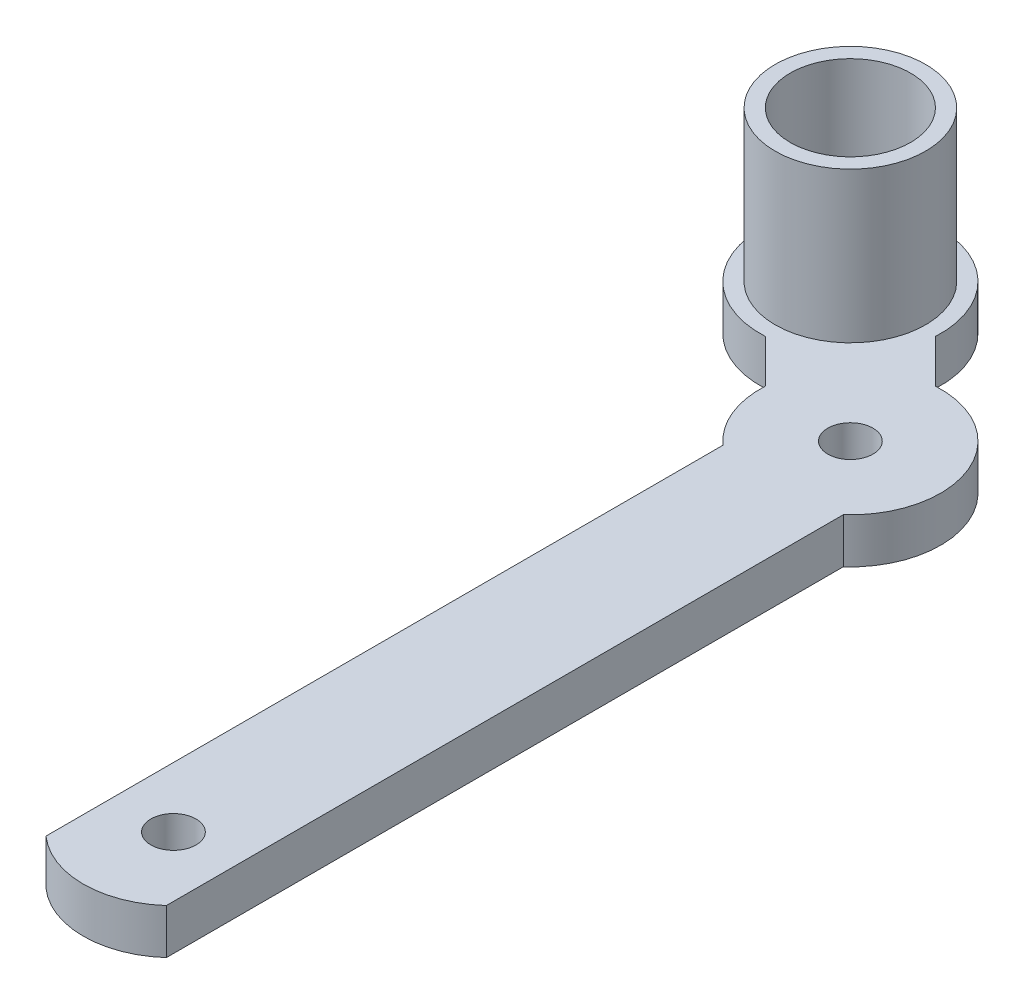
ISO-10303-21;
HEADER;
FILE_DESCRIPTION(('STEP AP214'),'2;1');
FILE_NAME('part.step','',(''),(''),'','','');
FILE_SCHEMA(('AUTOMOTIVE_DESIGN { 1 0 10303 214 1 1 1 1 }'));
ENDSEC;
DATA;
#1=APPLICATION_CONTEXT('core data for automotive mechanical design processes');
#2=APPLICATION_PROTOCOL_DEFINITION('international standard','automotive_design',2000,#1);
#3=PRODUCT_CONTEXT('',#1,'mechanical');
#4=PRODUCT('Part','Part','',(#3));
#5=PRODUCT_RELATED_PRODUCT_CATEGORY('part','',(#4));
#6=PRODUCT_DEFINITION_FORMATION('','',#4);
#7=PRODUCT_DEFINITION_CONTEXT('part definition',#1,'design');
#8=PRODUCT_DEFINITION('design','',#6,#7);
#9=PRODUCT_DEFINITION_SHAPE('','',#8);
#10=(LENGTH_UNIT() NAMED_UNIT(*) SI_UNIT(.MILLI.,.METRE.));
#11=(NAMED_UNIT(*) PLANE_ANGLE_UNIT() SI_UNIT($,.RADIAN.));
#12=(NAMED_UNIT(*) SI_UNIT($,.STERADIAN.) SOLID_ANGLE_UNIT());
#13=UNCERTAINTY_MEASURE_WITH_UNIT(LENGTH_MEASURE(1.E-05),#10,'distance_accuracy_value','');
#14=(GEOMETRIC_REPRESENTATION_CONTEXT(3) GLOBAL_UNCERTAINTY_ASSIGNED_CONTEXT((#13)) GLOBAL_UNIT_ASSIGNED_CONTEXT((#10,
#11,#12)) REPRESENTATION_CONTEXT('',''));
#15=CARTESIAN_POINT('',(0.,0.,0.));
#16=DIRECTION('',(0.,0.,1.));
#17=DIRECTION('',(1.,0.,0.));
#18=AXIS2_PLACEMENT_3D('',#15,#16,#17);
#19=CARTESIAN_POINT('',(0.,3.,0.));
#20=DIRECTION('',(0.,1.,0.));
#21=DIRECTION('',(0.,0.,1.));
#22=AXIS2_PLACEMENT_3D('',#19,#20,#21);
#23=PLANE('',#22);
#24=CARTESIAN_POINT('',(-9.19238815542517,3.,-54.1923881554251));
#25=DIRECTION('',(0.,1.,0.));
#26=DIRECTION('',(0.,0.,1.));
#27=AXIS2_PLACEMENT_3D('',#24,#25,#26);
#28=CIRCLE('',#27,3.);
#29=CARTESIAN_POINT('',(-9.19238815542517,3.,-51.1923881554251));
#30=VERTEX_POINT('',#29);
#31=EDGE_CURVE('E171',#30,#30,#28,.T.);
#32=ORIENTED_EDGE('',*,*,#31,.F.);
#33=EDGE_LOOP('',(#32));
#34=FACE_BOUND('',#33,.T.);
#35=CARTESIAN_POINT('',(-9.19238815542517,3.,-54.1923881554251));
#36=DIRECTION('',(0.,1.,0.));
#37=DIRECTION('',(0.,0.,1.));
#38=AXIS2_PLACEMENT_3D('',#35,#36,#37);
#39=CIRCLE('',#38,4.);
#40=CARTESIAN_POINT('',(-9.19238815542517,3.,-50.1923881554251));
#41=VERTEX_POINT('',#40);
#42=EDGE_CURVE('E11',#41,#41,#39,.F.);
#43=ORIENTED_EDGE('',*,*,#42,.F.);
#44=EDGE_LOOP('',(#43));
#45=FACE_BOUND('',#44,.T.);
#46=ADVANCED_FACE('F35',(#34,#45),#23,.T.);
#47=CARTESIAN_POINT('',(19.6715728752538,3.,-19.6715728752539));
#48=DIRECTION('',(-0.707106781186546,0.,0.707106781186549));
#49=DIRECTION('',(0.707106781186549,0.,0.707106781186546));
#50=AXIS2_PLACEMENT_3D('',#47,#48,#49);
#51=PLANE('',#50);
#52=DIRECTION('',(-0.707106781186549,0.,-0.707106781186546));
#53=VECTOR('',#52,1.);
#54=CARTESIAN_POINT('',(19.6715728752538,0.,-19.6715728752539));
#55=LINE('',#54,#53);
#56=CARTESIAN_POINT('',(-5.99070478491457,0.,-45.3338505354222));
#57=VERTEX_POINT('',#56);
#58=CARTESIAN_POINT('',(-8.85853762000289,0.,-48.2016833705105));
#59=VERTEX_POINT('',#58);
#60=EDGE_CURVE('E148',#57,#59,#55,.T.);
#61=ORIENTED_EDGE('',*,*,#60,.F.);
#62=DIRECTION('',(0.,-1.,0.));
#63=VECTOR('',#62,1.);
#64=CARTESIAN_POINT('',(-5.99070478491457,3.,-45.3338505354222));
#65=LINE('',#64,#63);
#66=CARTESIAN_POINT('',(-5.99070478491457,3.,-45.3338505354222));
#67=VERTEX_POINT('',#66);
#68=EDGE_CURVE('E44',#67,#57,#65,.T.);
#69=ORIENTED_EDGE('',*,*,#68,.F.);
#70=DIRECTION('',(-0.707106781186549,0.,-0.707106781186546));
#71=VECTOR('',#70,1.);
#72=CARTESIAN_POINT('',(19.6715728752538,3.,-19.6715728752539));
#73=LINE('',#72,#71);
#74=CARTESIAN_POINT('',(-8.85853762000289,3.,-48.2016833705105));
#75=VERTEX_POINT('',#74);
#76=EDGE_CURVE('E226',#67,#75,#73,.T.);
#77=ORIENTED_EDGE('',*,*,#76,.T.);
#78=DIRECTION('',(0.,-1.,0.));
#79=VECTOR('',#78,1.);
#80=CARTESIAN_POINT('',(-8.85853762000289,3.,-48.2016833705105));
#81=LINE('',#80,#79);
#82=EDGE_CURVE('E87',#75,#59,#81,.T.);
#83=ORIENTED_EDGE('',*,*,#82,.T.);
#84=EDGE_LOOP('',(#61,#69,#77,#83));
#85=FACE_BOUND('',#84,.T.);
#86=ADVANCED_FACE('F153',(#85),#51,.T.);
#87=CARTESIAN_POINT('',(0.,3.,-45.));
#88=DIRECTION('',(0.,-1.,0.));
#89=DIRECTION('',(0.,0.,-1.));
#90=AXIS2_PLACEMENT_3D('',#87,#88,#89);
#91=CYLINDRICAL_SURFACE('',#90,6.);
#92=CARTESIAN_POINT('',(0.,0.,-45.));
#93=DIRECTION('',(0.,1.,0.));
#94=DIRECTION('',(0.,0.,1.));
#95=AXIS2_PLACEMENT_3D('',#92,#93,#94);
#96=CIRCLE('',#95,6.);
#97=CARTESIAN_POINT('',(-4.,0.,-40.5278640450004));
#98=VERTEX_POINT('',#97);
#99=EDGE_CURVE('E144',#57,#98,#96,.T.);
#100=ORIENTED_EDGE('',*,*,#99,.T.);
#101=DIRECTION('',(0.,-1.,0.));
#102=VECTOR('',#101,1.);
#103=CARTESIAN_POINT('',(-4.,3.,-40.5278640450004));
#104=LINE('',#103,#102);
#105=CARTESIAN_POINT('',(-4.,3.,-40.5278640450004));
#106=VERTEX_POINT('',#105);
#107=EDGE_CURVE('E138',#106,#98,#104,.T.);
#108=ORIENTED_EDGE('',*,*,#107,.F.);
#109=CARTESIAN_POINT('',(0.,3.,-45.));
#110=DIRECTION('',(0.,1.,0.));
#111=DIRECTION('',(0.,0.,1.));
#112=AXIS2_PLACEMENT_3D('',#109,#110,#111);
#113=CIRCLE('',#112,6.);
#114=EDGE_CURVE('E146',#67,#106,#113,.T.);
#115=ORIENTED_EDGE('',*,*,#114,.F.);
#116=ORIENTED_EDGE('',*,*,#68,.T.);
#117=EDGE_LOOP('',(#100,#108,#115,#116));
#118=FACE_BOUND('',#117,.T.);
#119=ADVANCED_FACE('F142',(#118),#91,.T.);
#120=CARTESIAN_POINT('',(-4.,3.,0.));
#121=DIRECTION('',(-1.,0.,0.));
#122=DIRECTION('',(0.,0.,1.));
#123=AXIS2_PLACEMENT_3D('',#120,#121,#122);
#124=PLANE('',#123);
#125=DIRECTION('',(0.,0.,-1.));
#126=VECTOR('',#125,1.);
#127=CARTESIAN_POINT('',(-4.,0.,0.));
#128=LINE('',#127,#126);
#129=CARTESIAN_POINT('',(-4.,0.,4.47213595499958));
#130=VERTEX_POINT('',#129);
#131=EDGE_CURVE('E151',#130,#98,#128,.T.);
#132=ORIENTED_EDGE('',*,*,#131,.F.);
#133=DIRECTION('',(0.,-1.,0.));
#134=VECTOR('',#133,1.);
#135=CARTESIAN_POINT('',(-4.,3.,4.47213595499958));
#136=LINE('',#135,#134);
#137=CARTESIAN_POINT('',(-4.,3.,4.47213595499958));
#138=VERTEX_POINT('',#137);
#139=EDGE_CURVE('E136',#138,#130,#136,.T.);
#140=ORIENTED_EDGE('',*,*,#139,.F.);
#141=DIRECTION('',(0.,0.,-1.));
#142=VECTOR('',#141,1.);
#143=CARTESIAN_POINT('',(-4.,3.,0.));
#144=LINE('',#143,#142);
#145=EDGE_CURVE('E233',#138,#106,#144,.T.);
#146=ORIENTED_EDGE('',*,*,#145,.T.);
#147=ORIENTED_EDGE('',*,*,#107,.T.);
#148=EDGE_LOOP('',(#132,#140,#146,#147));
#149=FACE_BOUND('',#148,.T.);
#150=ADVANCED_FACE('F246',(#149),#124,.T.);
#151=CARTESIAN_POINT('',(0.,3.,0.));
#152=DIRECTION('',(0.,-1.,0.));
#153=DIRECTION('',(0.,0.,-1.));
#154=AXIS2_PLACEMENT_3D('',#151,#152,#153);
#155=CYLINDRICAL_SURFACE('',#154,6.);
#156=CARTESIAN_POINT('',(0.,0.,0.));
#157=DIRECTION('',(0.,1.,0.));
#158=DIRECTION('',(0.,0.,1.));
#159=AXIS2_PLACEMENT_3D('',#156,#157,#158);
#160=CIRCLE('',#159,6.);
#161=CARTESIAN_POINT('',(4.,0.,4.47213595499958));
#162=VERTEX_POINT('',#161);
#163=EDGE_CURVE('E162',#130,#162,#160,.T.);
#164=ORIENTED_EDGE('',*,*,#163,.T.);
#165=DIRECTION('',(0.,-1.,0.));
#166=VECTOR('',#165,1.);
#167=CARTESIAN_POINT('',(4.,3.,4.47213595499958));
#168=LINE('',#167,#166);
#169=CARTESIAN_POINT('',(4.,3.,4.47213595499958));
#170=VERTEX_POINT('',#169);
#171=EDGE_CURVE('E129',#170,#162,#168,.T.);
#172=ORIENTED_EDGE('',*,*,#171,.F.);
#173=CARTESIAN_POINT('',(0.,3.,0.));
#174=DIRECTION('',(0.,1.,0.));
#175=DIRECTION('',(0.,0.,1.));
#176=AXIS2_PLACEMENT_3D('',#173,#174,#175);
#177=CIRCLE('',#176,6.);
#178=EDGE_CURVE('E236',#138,#170,#177,.T.);
#179=ORIENTED_EDGE('',*,*,#178,.F.);
#180=ORIENTED_EDGE('',*,*,#139,.T.);
#181=EDGE_LOOP('',(#164,#172,#179,#180));
#182=FACE_BOUND('',#181,.T.);
#183=ADVANCED_FACE('F242',(#182),#155,.T.);
#184=CARTESIAN_POINT('',(4.,3.,0.));
#185=DIRECTION('',(-1.,0.,0.));
#186=DIRECTION('',(0.,0.,1.));
#187=AXIS2_PLACEMENT_3D('',#184,#185,#186);
#188=PLANE('',#187);
#189=DIRECTION('',(0.,0.,-1.));
#190=VECTOR('',#189,1.);
#191=CARTESIAN_POINT('',(4.,0.,0.));
#192=LINE('',#191,#190);
#193=CARTESIAN_POINT('',(4.,0.,-40.5278640450004));
#194=VERTEX_POINT('',#193);
#195=EDGE_CURVE('E165',#162,#194,#192,.T.);
#196=ORIENTED_EDGE('',*,*,#195,.T.);
#197=DIRECTION('',(0.,-1.,0.));
#198=VECTOR('',#197,1.);
#199=CARTESIAN_POINT('',(4.,3.,-40.5278640450004));
#200=LINE('',#199,#198);
#201=CARTESIAN_POINT('',(4.,3.,-40.5278640450004));
#202=VERTEX_POINT('',#201);
#203=EDGE_CURVE('E127',#202,#194,#200,.T.);
#204=ORIENTED_EDGE('',*,*,#203,.F.);
#205=DIRECTION('',(0.,0.,-1.));
#206=VECTOR('',#205,1.);
#207=CARTESIAN_POINT('',(4.,3.,0.));
#208=LINE('',#207,#206);
#209=EDGE_CURVE('E120',#170,#202,#208,.T.);
#210=ORIENTED_EDGE('',*,*,#209,.F.);
#211=ORIENTED_EDGE('',*,*,#171,.T.);
#212=EDGE_LOOP('',(#196,#204,#210,#211));
#213=FACE_BOUND('',#212,.T.);
#214=ADVANCED_FACE('F244',(#213),#188,.F.);
#215=CARTESIAN_POINT('',(0.,3.,-45.));
#216=DIRECTION('',(0.,-1.,0.));
#217=DIRECTION('',(0.,0.,-1.));
#218=AXIS2_PLACEMENT_3D('',#215,#216,#217);
#219=CYLINDRICAL_SURFACE('',#218,6.);
#220=CARTESIAN_POINT('',(0.,0.,-45.));
#221=DIRECTION('',(0.,1.,0.));
#222=DIRECTION('',(0.,0.,1.));
#223=AXIS2_PLACEMENT_3D('',#220,#221,#222);
#224=CIRCLE('',#223,6.);
#225=CARTESIAN_POINT('',(-0.3338505354222,0.,-50.9907047849146));
#226=VERTEX_POINT('',#225);
#227=EDGE_CURVE('E126',#194,#226,#224,.T.);
#228=ORIENTED_EDGE('',*,*,#227,.T.);
#229=DIRECTION('',(0.,-1.,0.));
#230=VECTOR('',#229,1.);
#231=CARTESIAN_POINT('',(-0.3338505354222,3.,-50.9907047849146));
#232=LINE('',#231,#230);
#233=CARTESIAN_POINT('',(-0.3338505354222,3.,-50.9907047849146));
#234=VERTEX_POINT('',#233);
#235=EDGE_CURVE('E112',#234,#226,#232,.T.);
#236=ORIENTED_EDGE('',*,*,#235,.F.);
#237=CARTESIAN_POINT('',(0.,3.,-45.));
#238=DIRECTION('',(0.,1.,0.));
#239=DIRECTION('',(0.,0.,1.));
#240=AXIS2_PLACEMENT_3D('',#237,#238,#239);
#241=CIRCLE('',#240,6.);
#242=EDGE_CURVE('E115',#202,#234,#241,.T.);
#243=ORIENTED_EDGE('',*,*,#242,.F.);
#244=ORIENTED_EDGE('',*,*,#203,.T.);
#245=EDGE_LOOP('',(#228,#236,#243,#244));
#246=FACE_BOUND('',#245,.T.);
#247=ADVANCED_FACE('F125',(#246),#219,.T.);
#248=CARTESIAN_POINT('',(25.3284271247462,3.,-25.3284271247461));
#249=DIRECTION('',(-0.707106781186548,0.,0.707106781186547));
#250=DIRECTION('',(0.707106781186547,0.,0.707106781186548));
#251=AXIS2_PLACEMENT_3D('',#248,#249,#250);
#252=PLANE('',#251);
#253=DIRECTION('',(-0.707106781186547,0.,-0.707106781186548));
#254=VECTOR('',#253,1.);
#255=CARTESIAN_POINT('',(25.3284271247462,0.,-25.3284271247461));
#256=LINE('',#255,#254);
#257=CARTESIAN_POINT('',(-3.20168337051059,0.,-53.858537620003));
#258=VERTEX_POINT('',#257);
#259=EDGE_CURVE('E169',#226,#258,#256,.T.);
#260=ORIENTED_EDGE('',*,*,#259,.T.);
#261=DIRECTION('',(0.,-1.,0.));
#262=VECTOR('',#261,1.);
#263=CARTESIAN_POINT('',(-3.20168337051059,3.,-53.858537620003));
#264=LINE('',#263,#262);
#265=CARTESIAN_POINT('',(-3.20168337051059,3.,-53.858537620003));
#266=VERTEX_POINT('',#265);
#267=EDGE_CURVE('E114',#266,#258,#264,.T.);
#268=ORIENTED_EDGE('',*,*,#267,.F.);
#269=DIRECTION('',(-0.707106781186547,0.,-0.707106781186548));
#270=VECTOR('',#269,1.);
#271=CARTESIAN_POINT('',(25.3284271247462,3.,-25.3284271247461));
#272=LINE('',#271,#270);
#273=EDGE_CURVE('E107',#234,#266,#272,.T.);
#274=ORIENTED_EDGE('',*,*,#273,.F.);
#275=ORIENTED_EDGE('',*,*,#235,.T.);
#276=EDGE_LOOP('',(#260,#268,#274,#275));
#277=FACE_BOUND('',#276,.T.);
#278=ADVANCED_FACE('F110',(#277),#252,.F.);
#279=CARTESIAN_POINT('',(0.,3.,-45.));
#280=DIRECTION('',(0.,-1.,0.));
#281=DIRECTION('',(0.,0.,-1.));
#282=AXIS2_PLACEMENT_3D('',#279,#280,#281);
#283=CYLINDRICAL_SURFACE('',#282,1.5);
#284=CARTESIAN_POINT('',(0.,3.,-45.));
#285=DIRECTION('',(0.,1.,0.));
#286=DIRECTION('',(0.,0.,1.));
#287=AXIS2_PLACEMENT_3D('',#284,#285,#286);
#288=CIRCLE('',#287,1.5);
#289=CARTESIAN_POINT('',(0.,3.,-43.5));
#290=VERTEX_POINT('',#289);
#291=EDGE_CURVE('E225',#290,#290,#288,.T.);
#292=ORIENTED_EDGE('',*,*,#291,.T.);
#293=EDGE_LOOP('',(#292));
#294=FACE_BOUND('',#293,.T.);
#295=CARTESIAN_POINT('',(0.,0.,-45.));
#296=DIRECTION('',(0.,1.,0.));
#297=DIRECTION('',(0.,0.,1.));
#298=AXIS2_PLACEMENT_3D('',#295,#296,#297);
#299=CIRCLE('',#298,1.5);
#300=CARTESIAN_POINT('',(0.,0.,-43.5));
#301=VERTEX_POINT('',#300);
#302=EDGE_CURVE('E154',#301,#301,#299,.T.);
#303=ORIENTED_EDGE('',*,*,#302,.F.);
#304=EDGE_LOOP('',(#303));
#305=FACE_BOUND('',#304,.T.);
#306=ADVANCED_FACE('F184',(#294,#305),#283,.F.);
#307=CARTESIAN_POINT('',(0.,3.,0.));
#308=DIRECTION('',(0.,-1.,0.));
#309=DIRECTION('',(0.,0.,-1.));
#310=AXIS2_PLACEMENT_3D('',#307,#308,#309);
#311=CYLINDRICAL_SURFACE('',#310,1.5);
#312=CARTESIAN_POINT('',(0.,3.,0.));
#313=DIRECTION('',(0.,1.,0.));
#314=DIRECTION('',(0.,0.,1.));
#315=AXIS2_PLACEMENT_3D('',#312,#313,#314);
#316=CIRCLE('',#315,1.5);
#317=CARTESIAN_POINT('',(0.,3.,1.5));
#318=VERTEX_POINT('',#317);
#319=EDGE_CURVE('E222',#318,#318,#316,.T.);
#320=ORIENTED_EDGE('',*,*,#319,.T.);
#321=EDGE_LOOP('',(#320));
#322=FACE_BOUND('',#321,.T.);
#323=CARTESIAN_POINT('',(0.,0.,0.));
#324=DIRECTION('',(0.,1.,0.));
#325=DIRECTION('',(0.,0.,1.));
#326=AXIS2_PLACEMENT_3D('',#323,#324,#325);
#327=CIRCLE('',#326,1.5);
#328=CARTESIAN_POINT('',(0.,0.,1.5));
#329=VERTEX_POINT('',#328);
#330=EDGE_CURVE('E157',#329,#329,#327,.T.);
#331=ORIENTED_EDGE('',*,*,#330,.F.);
#332=EDGE_LOOP('',(#331));
#333=FACE_BOUND('',#332,.T.);
#334=ADVANCED_FACE('F182',(#322,#333),#311,.F.);
#335=CARTESIAN_POINT('',(-9.19238815542517,3.,-54.1923881554251));
#336=DIRECTION('',(0.,-1.,0.));
#337=DIRECTION('',(0.,0.,-1.));
#338=AXIS2_PLACEMENT_3D('',#335,#336,#337);
#339=CYLINDRICAL_SURFACE('',#338,3.);
#340=ORIENTED_EDGE('',*,*,#31,.T.);
#341=EDGE_LOOP('',(#340));
#342=FACE_BOUND('',#341,.T.);
#343=CARTESIAN_POINT('',(-9.19238815542517,0.,-54.1923881554251));
#344=DIRECTION('',(0.,1.,0.));
#345=DIRECTION('',(0.,0.,1.));
#346=AXIS2_PLACEMENT_3D('',#343,#344,#345);
#347=CIRCLE('',#346,3.);
#348=CARTESIAN_POINT('',(-9.19238815542517,0.,-51.1923881554251));
#349=VERTEX_POINT('',#348);
#350=EDGE_CURVE('E174',#349,#349,#347,.T.);
#351=ORIENTED_EDGE('',*,*,#350,.F.);
#352=EDGE_LOOP('',(#351));
#353=FACE_BOUND('',#352,.T.);
#354=ADVANCED_FACE('F37',(#342,#353),#339,.F.);
#355=CARTESIAN_POINT('',(-9.19238815542517,3.,-54.1923881554251));
#356=DIRECTION('',(0.,-1.,0.));
#357=DIRECTION('',(0.,0.,-1.));
#358=AXIS2_PLACEMENT_3D('',#355,#356,#357);
#359=CYLINDRICAL_SURFACE('',#358,6.);
#360=CARTESIAN_POINT('',(-9.19238815542517,0.,-54.1923881554251));
#361=DIRECTION('',(0.,1.,0.));
#362=DIRECTION('',(0.,0.,1.));
#363=AXIS2_PLACEMENT_3D('',#360,#361,#362);
#364=CIRCLE('',#363,6.);
#365=EDGE_CURVE('E80',#258,#59,#364,.T.);
#366=ORIENTED_EDGE('',*,*,#365,.T.);
#367=ORIENTED_EDGE('',*,*,#82,.F.);
#368=CARTESIAN_POINT('',(-9.19238815542517,3.,-54.1923881554251));
#369=DIRECTION('',(0.,1.,0.));
#370=DIRECTION('',(0.,0.,1.));
#371=AXIS2_PLACEMENT_3D('',#368,#369,#370);
#372=CIRCLE('',#371,6.);
#373=EDGE_CURVE('E52',#266,#75,#372,.T.);
#374=ORIENTED_EDGE('',*,*,#373,.F.);
#375=ORIENTED_EDGE('',*,*,#267,.T.);
#376=EDGE_LOOP('',(#366,#367,#374,#375));
#377=FACE_BOUND('',#376,.T.);
#378=ADVANCED_FACE('F190',(#377),#359,.T.);
#379=CARTESIAN_POINT('',(-9.19238815542517,3.,-54.1923881554251));
#380=DIRECTION('',(0.,1.,0.));
#381=DIRECTION('',(0.,0.,1.));
#382=AXIS2_PLACEMENT_3D('',#379,#380,#381);
#383=CIRCLE('',#382,5.);
#384=CARTESIAN_POINT('',(-9.19238815542517,3.,-49.1923881554251));
#385=VERTEX_POINT('',#384);
#386=EDGE_CURVE('E219',#385,#385,#383,.T.);
#387=ORIENTED_EDGE('',*,*,#386,.F.);
#388=EDGE_LOOP('',(#387));
#389=FACE_BOUND('',#388,.T.);
#390=ORIENTED_EDGE('',*,*,#319,.F.);
#391=EDGE_LOOP('',(#390));
#392=FACE_BOUND('',#391,.T.);
#393=ORIENTED_EDGE('',*,*,#291,.F.);
#394=EDGE_LOOP('',(#393));
#395=FACE_BOUND('',#394,.T.);
#396=ORIENTED_EDGE('',*,*,#76,.F.);
#397=ORIENTED_EDGE('',*,*,#114,.T.);
#398=ORIENTED_EDGE('',*,*,#145,.F.);
#399=ORIENTED_EDGE('',*,*,#178,.T.);
#400=ORIENTED_EDGE('',*,*,#209,.T.);
#401=ORIENTED_EDGE('',*,*,#242,.T.);
#402=ORIENTED_EDGE('',*,*,#273,.T.);
#403=ORIENTED_EDGE('',*,*,#373,.T.);
#404=EDGE_LOOP('',(#396,#397,#398,#399,#400,#401,#402,#403));
#405=FACE_BOUND('',#404,.T.);
#406=ADVANCED_FACE('F118',(#389,#392,#395,#405),#23,.T.);
#407=CARTESIAN_POINT('',(0.,0.,0.));
#408=DIRECTION('',(0.,1.,0.));
#409=DIRECTION('',(0.,0.,1.));
#410=AXIS2_PLACEMENT_3D('',#407,#408,#409);
#411=PLANE('',#410);
#412=ORIENTED_EDGE('',*,*,#350,.T.);
#413=EDGE_LOOP('',(#412));
#414=FACE_BOUND('',#413,.T.);
#415=ORIENTED_EDGE('',*,*,#330,.T.);
#416=EDGE_LOOP('',(#415));
#417=FACE_BOUND('',#416,.T.);
#418=ORIENTED_EDGE('',*,*,#302,.T.);
#419=EDGE_LOOP('',(#418));
#420=FACE_BOUND('',#419,.T.);
#421=ORIENTED_EDGE('',*,*,#60,.T.);
#422=ORIENTED_EDGE('',*,*,#365,.F.);
#423=ORIENTED_EDGE('',*,*,#259,.F.);
#424=ORIENTED_EDGE('',*,*,#227,.F.);
#425=ORIENTED_EDGE('',*,*,#195,.F.);
#426=ORIENTED_EDGE('',*,*,#163,.F.);
#427=ORIENTED_EDGE('',*,*,#131,.T.);
#428=ORIENTED_EDGE('',*,*,#99,.F.);
#429=EDGE_LOOP('',(#421,#422,#423,#424,#425,#426,#427,#428));
#430=FACE_BOUND('',#429,.T.);
#431=ADVANCED_FACE('F147',(#414,#417,#420,#430),#411,.F.);
#432=CARTESIAN_POINT('',(-9.19238815542517,13.,-54.1923881554251));
#433=DIRECTION('',(0.,-1.,0.));
#434=DIRECTION('',(0.,0.,-1.));
#435=AXIS2_PLACEMENT_3D('',#432,#433,#434);
#436=CYLINDRICAL_SURFACE('',#435,4.);
#437=CARTESIAN_POINT('',(-9.19238815542517,13.,-54.1923881554251));
#438=DIRECTION('',(0.,1.,0.));
#439=DIRECTION('',(0.,0.,1.));
#440=AXIS2_PLACEMENT_3D('',#437,#438,#439);
#441=CIRCLE('',#440,4.);
#442=CARTESIAN_POINT('',(-9.19238815542517,13.,-50.1923881554251));
#443=VERTEX_POINT('',#442);
#444=EDGE_CURVE('E337',#443,#443,#441,.T.);
#445=ORIENTED_EDGE('',*,*,#444,.T.);
#446=EDGE_LOOP('',(#445));
#447=FACE_BOUND('',#446,.T.);
#448=ORIENTED_EDGE('',*,*,#42,.T.);
#449=EDGE_LOOP('',(#448));
#450=FACE_BOUND('',#449,.T.);
#451=ADVANCED_FACE('F212',(#447,#450),#436,.F.);
#452=CARTESIAN_POINT('',(-9.19238815542517,13.,-54.1923881554251));
#453=DIRECTION('',(0.,-1.,0.));
#454=DIRECTION('',(0.,0.,-1.));
#455=AXIS2_PLACEMENT_3D('',#452,#453,#454);
#456=CYLINDRICAL_SURFACE('',#455,5.);
#457=CARTESIAN_POINT('',(-9.19238815542517,13.,-54.1923881554251));
#458=DIRECTION('',(0.,1.,0.));
#459=DIRECTION('',(0.,0.,1.));
#460=AXIS2_PLACEMENT_3D('',#457,#458,#459);
#461=CIRCLE('',#460,5.);
#462=CARTESIAN_POINT('',(-9.19238815542517,13.,-49.1923881554251));
#463=VERTEX_POINT('',#462);
#464=EDGE_CURVE('E176',#463,#463,#461,.T.);
#465=ORIENTED_EDGE('',*,*,#464,.F.);
#466=EDGE_LOOP('',(#465));
#467=FACE_BOUND('',#466,.T.);
#468=ORIENTED_EDGE('',*,*,#386,.T.);
#469=EDGE_LOOP('',(#468));
#470=FACE_BOUND('',#469,.T.);
#471=ADVANCED_FACE('F311',(#467,#470),#456,.T.);
#472=CARTESIAN_POINT('',(0.,13.,0.));
#473=DIRECTION('',(0.,1.,0.));
#474=DIRECTION('',(0.,0.,1.));
#475=AXIS2_PLACEMENT_3D('',#472,#473,#474);
#476=PLANE('',#475);
#477=ORIENTED_EDGE('',*,*,#444,.F.);
#478=EDGE_LOOP('',(#477));
#479=FACE_BOUND('',#478,.T.);
#480=ORIENTED_EDGE('',*,*,#464,.T.);
#481=EDGE_LOOP('',(#480));
#482=FACE_BOUND('',#481,.T.);
#483=ADVANCED_FACE('F320',(#479,#482),#476,.T.);
#484=CLOSED_SHELL('',(#46,#86,#119,#150,#183,#214,#247,#278,#306,#334,#354,#378,#406,#431,#451,
#471,#483));
#485=MANIFOLD_SOLID_BREP('B2',#484);
#486=ADVANCED_BREP_SHAPE_REPRESENTATION('',(#18,#485),#14);
#487=SHAPE_DEFINITION_REPRESENTATION(#9,#486);
ENDSEC;
END-ISO-10303-21;
